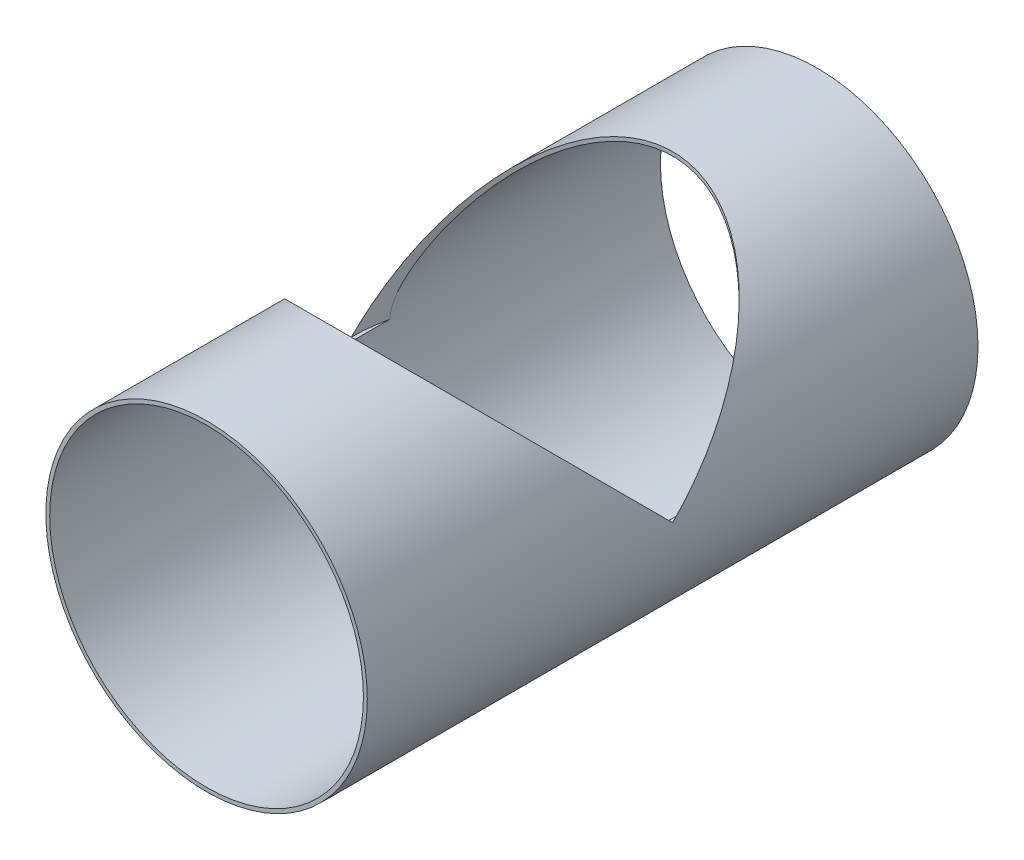
ISO-10303-21;
HEADER;
FILE_DESCRIPTION(('STEP AP214'),'2;1');
FILE_NAME('part.step','',(''),(''),'','','');
FILE_SCHEMA(('AUTOMOTIVE_DESIGN { 1 0 10303 214 1 1 1 1 }'));
ENDSEC;
DATA;
#1=APPLICATION_CONTEXT('core data for automotive mechanical design processes');
#2=APPLICATION_PROTOCOL_DEFINITION('international standard','automotive_design',2000,#1);
#3=PRODUCT_CONTEXT('',#1,'mechanical');
#4=PRODUCT('Part','Part','',(#3));
#5=PRODUCT_RELATED_PRODUCT_CATEGORY('part','',(#4));
#6=PRODUCT_DEFINITION_FORMATION('','',#4);
#7=PRODUCT_DEFINITION_CONTEXT('part definition',#1,'design');
#8=PRODUCT_DEFINITION('design','',#6,#7);
#9=PRODUCT_DEFINITION_SHAPE('','',#8);
#10=(LENGTH_UNIT() NAMED_UNIT(*) SI_UNIT(.MILLI.,.METRE.));
#11=(NAMED_UNIT(*) PLANE_ANGLE_UNIT() SI_UNIT($,.RADIAN.));
#12=(NAMED_UNIT(*) SI_UNIT($,.STERADIAN.) SOLID_ANGLE_UNIT());
#13=UNCERTAINTY_MEASURE_WITH_UNIT(LENGTH_MEASURE(1.E-05),#10,'distance_accuracy_value','');
#14=(GEOMETRIC_REPRESENTATION_CONTEXT(3) GLOBAL_UNCERTAINTY_ASSIGNED_CONTEXT((#13)) GLOBAL_UNIT_ASSIGNED_CONTEXT((#10,
#11,#12)) REPRESENTATION_CONTEXT('',''));
#15=CARTESIAN_POINT('',(0.,0.,0.));
#16=DIRECTION('',(0.,0.,1.));
#17=DIRECTION('',(1.,0.,0.));
#18=AXIS2_PLACEMENT_3D('',#15,#16,#17);
#19=CARTESIAN_POINT('',(0.,0.,241.3));
#20=DIRECTION('',(0.,-1.,0.));
#21=DIRECTION('',(0.,0.,-1.));
#22=AXIS2_PLACEMENT_3D('',#19,#20,#21);
#23=PLANE('',#22);
#24=CARTESIAN_POINT('',(0.,0.,241.3));
#25=DIRECTION('',(0.,1.,0.));
#26=DIRECTION('',(0.,0.,1.));
#27=AXIS2_PLACEMENT_3D('',#24,#25,#26);
#28=CIRCLE('',#27,127.);
#29=CARTESIAN_POINT('',(-123.952,0.,213.643143779526));
#30=VERTEX_POINT('',#29);
#31=CARTESIAN_POINT('',(-127.,0.,241.3));
#32=VERTEX_POINT('',#31);
#33=EDGE_CURVE('E34',#30,#32,#28,.T.);
#34=ORIENTED_EDGE('',*,*,#33,.T.);
#35=CARTESIAN_POINT('',(0.,0.,241.3));
#36=DIRECTION('',(0.,1.,0.));
#37=DIRECTION('',(0.,0.,1.));
#38=AXIS2_PLACEMENT_3D('',#35,#36,#37);
#39=CIRCLE('',#38,127.);
#40=CARTESIAN_POINT('',(-123.952,0.,268.956856220475));
#41=VERTEX_POINT('',#40);
#42=EDGE_CURVE('E67',#32,#41,#39,.T.);
#43=ORIENTED_EDGE('',*,*,#42,.T.);
#44=DIRECTION('',(0.,0.,1.));
#45=VECTOR('',#44,1.);
#46=CARTESIAN_POINT('',(-123.952,0.,0.));
#47=LINE('',#46,#45);
#48=EDGE_CURVE('E59',#41,#30,#47,.F.);
#49=ORIENTED_EDGE('',*,*,#48,.T.);
#50=EDGE_LOOP('',(#34,#43,#49));
#51=FACE_BOUND('',#50,.T.);
#52=ADVANCED_FACE('F17',(#51),#23,.F.);
#53=CARTESIAN_POINT('',(0.,0.,241.3));
#54=DIRECTION('',(0.,-1.,0.));
#55=DIRECTION('',(0.,0.,-1.));
#56=AXIS2_PLACEMENT_3D('',#53,#54,#55);
#57=PLANE('',#56);
#58=CARTESIAN_POINT('',(0.,0.,241.3));
#59=DIRECTION('',(0.,1.,0.));
#60=DIRECTION('',(0.,0.,1.));
#61=AXIS2_PLACEMENT_3D('',#58,#59,#60);
#62=CIRCLE('',#61,127.);
#63=CARTESIAN_POINT('',(123.952,0.,268.956856220475));
#64=VERTEX_POINT('',#63);
#65=CARTESIAN_POINT('',(127.,0.,241.3));
#66=VERTEX_POINT('',#65);
#67=EDGE_CURVE('E52',#64,#66,#62,.T.);
#68=ORIENTED_EDGE('',*,*,#67,.T.);
#69=CARTESIAN_POINT('',(0.,0.,241.3));
#70=DIRECTION('',(0.,1.,0.));
#71=DIRECTION('',(0.,0.,1.));
#72=AXIS2_PLACEMENT_3D('',#69,#70,#71);
#73=CIRCLE('',#72,127.);
#74=CARTESIAN_POINT('',(123.952,0.,213.643143779525));
#75=VERTEX_POINT('',#74);
#76=EDGE_CURVE('E55',#66,#75,#73,.T.);
#77=ORIENTED_EDGE('',*,*,#76,.T.);
#78=DIRECTION('',(0.,0.,1.));
#79=VECTOR('',#78,1.);
#80=CARTESIAN_POINT('',(123.952,0.,0.));
#81=LINE('',#80,#79);
#82=EDGE_CURVE('E48',#75,#64,#81,.T.);
#83=ORIENTED_EDGE('',*,*,#82,.T.);
#84=EDGE_LOOP('',(#68,#77,#83));
#85=FACE_BOUND('',#84,.T.);
#86=ADVANCED_FACE('F50',(#85),#57,.F.);
#87=CARTESIAN_POINT('',(0.,0.,0.));
#88=DIRECTION('',(0.,0.,1.));
#89=DIRECTION('',(1.,0.,0.));
#90=AXIS2_PLACEMENT_3D('',#87,#88,#89);
#91=CYLINDRICAL_SURFACE('',#90,123.952);
#92=CARTESIAN_POINT('',(0.,0.,0.));
#93=DIRECTION('',(0.,0.,1.));
#94=DIRECTION('',(1.,0.,0.));
#95=AXIS2_PLACEMENT_3D('',#92,#93,#94);
#96=CIRCLE('',#95,123.952);
#97=CARTESIAN_POINT('',(123.952,0.,0.));
#98=VERTEX_POINT('',#97);
#99=EDGE_CURVE('E115',#98,#98,#96,.T.);
#100=ORIENTED_EDGE('',*,*,#99,.F.);
#101=EDGE_LOOP('',(#100));
#102=FACE_BOUND('',#101,.T.);
#103=ORIENTED_EDGE('',*,*,#48,.F.);
#104=CARTESIAN_POINT('',(-123.952,0.,268.956856220475));
#105=CARTESIAN_POINT('',(-123.952011020941,0.489693864072951,268.956767550672));
#106=CARTESIAN_POINT('',(-123.949098421413,0.979353674165115,268.969859645185));
#107=CARTESIAN_POINT('',(-123.93750960443,1.95710301510144,269.021742255334));
#108=CARTESIAN_POINT('',(-123.928835074181,2.44519296360327,269.060525248166));
#109=CARTESIAN_POINT('',(-123.905844464658,3.41695982621533,269.162955575909));
#110=CARTESIAN_POINT('',(-123.891547363117,3.90064604262523,269.226519262929));
#111=CARTESIAN_POINT('',(-123.857463468549,4.86410426457651,269.377298750678));
#112=CARTESIAN_POINT('',(-123.837676342107,5.34387603056616,269.46451598791));
#113=CARTESIAN_POINT('',(-123.771365120799,6.75418303034597,269.755022157157));
#114=CARTESIAN_POINT('',(-123.717344072959,7.6780339392297,269.989658671327));
#115=CARTESIAN_POINT('',(-123.590544546681,9.50339339249372,270.531047692229));
#116=CARTESIAN_POINT('',(-123.517749587749,10.4048815398839,270.837863539996));
#117=CARTESIAN_POINT('',(-123.352351129205,12.2125326181803,271.521265365455));
#118=CARTESIAN_POINT('',(-123.259183593303,13.1179054398859,271.899785371579));
#119=CARTESIAN_POINT('',(-123.055967836939,14.9042178249446,272.707038253618));
#120=CARTESIAN_POINT('',(-122.945912775111,15.7851473144156,273.135791462967));
#121=CARTESIAN_POINT('',(-122.70994299976,17.5254176891227,274.033555165375));
#122=CARTESIAN_POINT('',(-122.584007328721,18.3847282127419,274.502618590091));
#123=CARTESIAN_POINT('',(-122.317279917598,20.0828259226082,275.472150464939));
#124=CARTESIAN_POINT('',(-122.176490027225,20.9216156482066,275.972615001731));
#125=CARTESIAN_POINT('',(-121.877890985743,22.5968008697635,277.008200649651));
#126=CARTESIAN_POINT('',(-121.719810830721,23.4328525638902,277.543797502889));
#127=CARTESIAN_POINT('',(-121.389368919165,25.0884823042615,278.635593099761));
#128=CARTESIAN_POINT('',(-121.21700693182,25.9080600840031,279.19179217627));
#129=CARTESIAN_POINT('',(-120.858492510236,27.5320539348548,280.320187189937));
#130=CARTESIAN_POINT('',(-120.672350900777,28.3364812972864,280.892370355091));
#131=CARTESIAN_POINT('',(-120.286402868233,29.9324829816578,282.04989114035));
#132=CARTESIAN_POINT('',(-120.086596199326,30.7240570720626,282.635228996968));
#133=CARTESIAN_POINT('',(-119.598503871152,32.5810233544121,284.030841468407));
#134=CARTESIAN_POINT('',(-119.304429892846,33.6415000531877,284.845634396049));
#135=CARTESIAN_POINT('',(-118.691467616286,35.7439882342735,286.489661676147));
#136=CARTESIAN_POINT('',(-118.372577707113,36.7859985124416,287.318896963409));
#137=CARTESIAN_POINT('',(-117.710051942199,38.8538401567015,288.988050366681));
#138=CARTESIAN_POINT('',(-117.366410793882,39.8796680049844,289.827970735688));
#139=CARTESIAN_POINT('',(-116.6544649144,41.9165602011641,291.515280845261));
#140=CARTESIAN_POINT('',(-116.286159362418,42.9276240563582,292.362670833596));
#141=CARTESIAN_POINT('',(-115.524417491543,44.9373272960421,294.063416734757));
#142=CARTESIAN_POINT('',(-115.130952746341,45.935951047356,294.916778389875));
#143=CARTESIAN_POINT('',(-114.319181973177,47.9204759738686,296.626489769393));
#144=CARTESIAN_POINT('',(-113.900875323978,48.9063768301466,297.482839568014));
#145=CARTESIAN_POINT('',(-112.608621730792,51.8457346124009,300.053514346088));
#146=CARTESIAN_POINT('',(-111.697206682503,53.7812011998046,301.769766380162));
#147=CARTESIAN_POINT('',(-109.779744549404,57.5936322197357,305.184406161588));
#148=CARTESIAN_POINT('',(-108.774384921229,59.4709055160068,306.882835933242));
#149=CARTESIAN_POINT('',(-106.662049244613,63.1811880251185,310.265084281451));
#150=CARTESIAN_POINT('',(-105.555068917935,65.0141953702522,311.948902239577));
#151=CARTESIAN_POINT('',(-103.238451263471,68.6333229350197,315.29295177185));
#152=CARTESIAN_POINT('',(-102.028890333737,70.4194767735353,316.953199842601));
#153=CARTESIAN_POINT('',(-99.5043749570593,73.9437325191284,320.244157771456));
#154=CARTESIAN_POINT('',(-98.1894285583283,75.6818380820093,321.874869873562));
#155=CARTESIAN_POINT('',(-95.8164892483885,78.6503955816738,324.670307647633));
#156=CARTESIAN_POINT('',(-94.7833249333374,79.8927720294098,325.843477912037));
#157=CARTESIAN_POINT('',(-92.6582348627995,82.3479592227882,328.167320059574));
#158=CARTESIAN_POINT('',(-91.566305860621,83.560768329474,329.317990694827));
#159=CARTESIAN_POINT('',(-88.2008102416357,87.1520539125724,332.732099185853));
#160=CARTESIAN_POINT('',(-85.8373095084628,89.4836721545077,334.957901068499));
#161=CARTESIAN_POINT('',(-82.1101491212451,92.8700071111859,338.200128643643));
#162=CARTESIAN_POINT('',(-80.8376024358126,93.9801475665536,339.264673944297));
#163=CARTESIAN_POINT('',(-78.2308789080266,96.1608828791661,341.358603078765));
#164=CARTESIAN_POINT('',(-76.8967011996589,97.2314771803438,342.387986418144));
#165=CARTESIAN_POINT('',(-74.1668149208836,99.3294734524527,344.407542665146));
#166=CARTESIAN_POINT('',(-72.7711223492047,100.356886519699,345.397725642273));
#167=CARTESIAN_POINT('',(-69.9179165276626,102.365168028943,347.335180358721));
#168=CARTESIAN_POINT('',(-68.4604023202155,103.346035749481,348.282451432889));
#169=CARTESIAN_POINT('',(-64.697341304826,105.762258286555,350.617961316481));
#170=CARTESIAN_POINT('',(-62.3503465969223,107.164147479397,351.974961904854));
#171=CARTESIAN_POINT('',(-58.7247549461614,109.166886582171,353.915646145208));
#172=CARTESIAN_POINT('',(-57.4986299434309,109.817820420253,354.546773657985));
#173=CARTESIAN_POINT('',(-55.0118154725324,111.08440430463,355.775424804105));
#174=CARTESIAN_POINT('',(-53.7511288000726,111.70005719244,356.372951143601));
#175=CARTESIAN_POINT('',(-51.1963880624102,112.893825004869,357.532082749855));
#176=CARTESIAN_POINT('',(-49.9023427942914,113.47194968749,358.093697353731));
#177=CARTESIAN_POINT('',(-47.2818110959667,114.588641929481,359.178926172497));
#178=CARTESIAN_POINT('',(-45.9553281994291,115.127213772268,359.70254450216));
#179=CARTESIAN_POINT('',(-43.2709850284515,116.162773567905,360.709702928074));
#180=CARTESIAN_POINT('',(-41.9131199487956,116.659755097918,361.193236833935));
#181=CARTESIAN_POINT('',(-39.1680688961801,117.609820458803,362.117878022704));
#182=CARTESIAN_POINT('',(-37.7808863044784,118.062909318628,362.558990165994));
#183=CARTESIAN_POINT('',(-34.9647768110714,118.927516512668,363.4009669319));
#184=CARTESIAN_POINT('',(-33.5355684570793,119.338563753142,363.801375199479));
#185=CARTESIAN_POINT('',(-30.6515596706631,120.111651946725,364.554626930098));
#186=CARTESIAN_POINT('',(-29.1967591914413,120.47369281021,364.907470306151));
#187=CARTESIAN_POINT('',(-26.2642892920391,121.146805734807,365.563609291978));
#188=CARTESIAN_POINT('',(-24.7866190962499,121.457876063129,365.866903217272));
#189=CARTESIAN_POINT('',(-21.8115729774985,122.027239932611,366.422120360976));
#190=CARTESIAN_POINT('',(-20.3141971400322,122.28553370267,366.674043802186));
#191=CARTESIAN_POINT('',(-17.304524795442,122.747576259917,367.12474552996));
#192=CARTESIAN_POINT('',(-15.7922430915943,122.951374424678,367.32357192667));
#193=CARTESIAN_POINT('',(-12.7550876580271,123.303459280308,367.667097288876));
#194=CARTESIAN_POINT('',(-11.2302137985748,123.451745398524,367.811795695996));
#195=CARTESIAN_POINT('',(-8.17202814603243,123.69182871092,368.046082774924));
#196=CARTESIAN_POINT('',(-6.63871760409742,123.78363406487,368.135679407276));
#197=CARTESIAN_POINT('',(-3.56754101802112,123.910179949448,368.259183198254));
#198=CARTESIAN_POINT('',(-2.02967517190124,123.94492292517,368.293092743042));
#199=CARTESIAN_POINT('',(0.811049251287533,123.956193318992,368.304092706703));
#200=CARTESIAN_POINT('',(2.11385800147762,123.940815638354,368.289083853325));
#201=CARTESIAN_POINT('',(4.71726203527143,123.86904900599,368.21904086711));
#202=CARTESIAN_POINT('',(6.01785735497199,123.812660729619,368.164007393391));
#203=CARTESIAN_POINT('',(8.61417234088342,123.659149630658,368.014192984702));
#204=CARTESIAN_POINT('',(9.90989259961644,123.562031931107,367.919417048629));
#205=CARTESIAN_POINT('',(12.4942063388951,123.327517395619,367.690575542086));
#206=CARTESIAN_POINT('',(13.7827997485841,123.190120159946,367.556509581699));
#207=CARTESIAN_POINT('',(16.3505198858346,122.875676455128,367.249721601852));
#208=CARTESIAN_POINT('',(17.6296464938693,122.698629486249,367.076999095176));
#209=CARTESIAN_POINT('',(20.1761906210981,122.305680467752,366.693697205242));
#210=CARTESIAN_POINT('',(21.4436081810691,122.089778553501,366.483117953872));
#211=CARTESIAN_POINT('',(23.9646863885406,121.620048905917,366.025038744343));
#212=CARTESIAN_POINT('',(25.2183467198734,121.366220302906,365.777537939554));
#213=CARTESIAN_POINT('',(27.7099731558745,120.821694695203,365.246681803874));
#214=CARTESIAN_POINT('',(28.9479390908207,120.530997292177,364.963326085605));
#215=CARTESIAN_POINT('',(31.3816853909027,119.920100176779,364.367979297532));
#216=CARTESIAN_POINT('',(32.5778134679895,119.6006112711,364.056678632142));
#217=CARTESIAN_POINT('',(34.9517726567348,118.928523665959,363.401964257631));
#218=CARTESIAN_POINT('',(36.1296044291648,118.57592616547,363.058551711391));
#219=CARTESIAN_POINT('',(38.4655781448433,117.838861766246,362.340869080338));
#220=CARTESIAN_POINT('',(39.623722244966,117.454398386035,361.966602402358));
#221=CARTESIAN_POINT('',(41.9193800027819,116.654797699763,361.188427634307));
#222=CARTESIAN_POINT('',(43.0568910578416,116.23965655709,360.784515836811));
#223=CARTESIAN_POINT('',(46.4367346419114,114.950169291023,359.530297144875));
#224=CARTESIAN_POINT('',(48.6467312795801,114.031647177511,358.637397715076));
#225=CARTESIAN_POINT('',(52.9736193474211,112.087121516104,356.748564790205));
#226=CARTESIAN_POINT('',(55.0904910067922,111.061095299531,355.752609564992));
#227=CARTESIAN_POINT('',(58.6772860917251,109.197091271813,353.944881964946));
#228=CARTESIAN_POINT('',(60.1697396115705,108.381523304644,353.154425625256));
#229=CARTESIAN_POINT('',(63.1007544810336,106.701666420436,351.527508098131));
#230=CARTESIAN_POINT('',(64.5393255188766,105.837386332657,350.691055248406));
#231=CARTESIAN_POINT('',(67.3627192979342,104.063170574076,348.975410548933));
#232=CARTESIAN_POINT('',(68.7475203148485,103.153216783577,348.096201741396));
#233=CARTESIAN_POINT('',(71.4625421418936,101.291229465009,346.298836882957));
#234=CARTESIAN_POINT('',(72.7927601952655,100.339193816593,345.380678869644));
#235=CARTESIAN_POINT('',(75.4017554216645,98.3937394704166,343.506464588534));
#236=CARTESIAN_POINT('',(76.6803975451992,97.4002244438479,342.550320385539));
#237=CARTESIAN_POINT('',(79.1828479850641,95.3769575792425,340.60552892521));
#238=CARTESIAN_POINT('',(80.406657499111,94.3472065335925,339.616882378649));
#239=CARTESIAN_POINT('',(83.9964541554987,91.2074655672228,336.606600605882));
#240=CARTESIAN_POINT('',(86.281307446932,89.0466142377244,334.540263003044));
#241=CARTESIAN_POINT('',(89.955557294752,85.3033402513457,330.973564644128));
#242=CARTESIAN_POINT('',(91.4014198815321,83.7515182850217,329.498445455526));
#243=CARTESIAN_POINT('',(94.1945676479981,80.5972651873877,326.508963304341));
#244=CARTESIAN_POINT('',(95.5418450712251,78.9948300881197,324.994597266571));
#245=CARTESIAN_POINT('',(98.1399669602662,75.7428476295021,321.932380704931));
#246=CARTESIAN_POINT('',(99.390769068584,74.0932800073085,320.384515851046));
#247=CARTESIAN_POINT('',(101.797157809629,70.7508130529787,317.261987103669));
#248=CARTESIAN_POINT('',(102.952747154979,69.0579149571353,315.687323975208));
#249=CARTESIAN_POINT('',(105.168365905974,65.6343102433315,312.520376072715));
#250=CARTESIAN_POINT('',(106.228578544209,63.9036844163572,310.928131984236));
#251=CARTESIAN_POINT('',(108.257703162176,60.4025027820099,307.729337343083));
#252=CARTESIAN_POINT('',(109.226611962659,58.6319455868623,306.122786294364));
#253=CARTESIAN_POINT('',(111.074116282934,55.0517487196469,302.903433832669));
#254=CARTESIAN_POINT('',(111.952756827728,53.2421290820266,301.290635956242));
#255=CARTESIAN_POINT('',(113.6214492402,49.581364212685,298.06670881502));
#256=CARTESIAN_POINT('',(114.411510209338,47.7302232707333,296.455579395679));
#257=CARTESIAN_POINT('',(115.757785125788,44.3493356589938,293.560506612851));
#258=CARTESIAN_POINT('',(116.329488244083,42.8276764223616,292.2743032956));
#259=CARTESIAN_POINT('',(117.416418427006,39.7510395465123,289.718106452104));
#260=CARTESIAN_POINT('',(117.931648664716,38.1960637851494,288.448112018666));
#261=CARTESIAN_POINT('',(118.907200498239,35.0415821737985,285.930750107903));
#262=CARTESIAN_POINT('',(119.367330108593,33.441943280929,284.683473890261));
#263=CARTESIAN_POINT('',(120.014191411341,31.0063954120127,282.845359616531));
#264=CARTESIAN_POINT('',(120.222583979723,30.1885566288142,282.23813950726));
#265=CARTESIAN_POINT('',(120.624745878574,28.5392640028473,281.037530308266));
#266=CARTESIAN_POINT('',(120.818515646855,27.7078105686139,280.444140804819));
#267=CARTESIAN_POINT('',(121.272796036673,25.6619598739746,279.018518140726));
#268=CARTESIAN_POINT('',(121.525371963533,24.4393211793623,278.195492273793));
#269=CARTESIAN_POINT('',(121.99862002384,21.9552748714282,276.599142751869));
#270=CARTESIAN_POINT('',(122.219284663846,20.6938582362783,275.825830794354));
#271=CARTESIAN_POINT('',(122.624624300902,18.1372324999578,274.357157513543));
#272=CARTESIAN_POINT('',(122.809632411179,16.8424786861095,273.661103356247));
#273=CARTESIAN_POINT('',(123.143180351298,14.1995430322556,272.367706304122));
#274=CARTESIAN_POINT('',(123.29173922055,12.8513895150915,271.770311927493));
#275=CARTESIAN_POINT('',(123.503839952023,10.5699860948421,270.896113818204));
#276=CARTESIAN_POINT('',(123.579063161223,9.65308396372725,270.57963923742));
#277=CARTESIAN_POINT('',(123.71009110791,7.79591027309665,270.021000245555));
#278=CARTESIAN_POINT('',(123.765914057037,6.85566152323024,269.778766167928));
#279=CARTESIAN_POINT('',(123.834315964661,5.42179032889008,269.479298094068));
#280=CARTESIAN_POINT('',(123.854678678369,4.93518690557021,269.38958684583));
#281=CARTESIAN_POINT('',(123.889758597162,3.95790114351653,269.234459770035));
#282=CARTESIAN_POINT('',(123.904476162782,3.46721906731704,269.169042390926));
#283=CARTESIAN_POINT('',(123.928145853596,2.48128343536041,269.063605089683));
#284=CARTESIAN_POINT('',(123.93707806385,1.9860199791888,269.023672902107));
#285=CARTESIAN_POINT('',(123.949011885285,0.993850190394975,268.970247426332));
#286=CARTESIAN_POINT('',(123.952011666046,0.496943398084879,268.956762298252));
#287=CARTESIAN_POINT('',(123.952,0.,268.956856220474));
#288=B_SPLINE_CURVE_WITH_KNOTS('',3,(#104,#105,#106,#107,#108,#109,#110,#111,#112,#113,#114,
#115,#116,#117,#118,#119,#120,#121,#122,#123,#124,#125,#126,#127,#128,#129,#130,#131,#132,#133,
#134,#135,#136,#137,#138,#139,#140,#141,#142,#143,#144,#145,#146,#147,#148,#149,#150,#151,#152,
#153,#154,#155,#156,#157,#158,#159,#160,#161,#162,#163,#164,#165,#166,#167,#168,#169,#170,#171,
#172,#173,#174,#175,#176,#177,#178,#179,#180,#181,#182,#183,#184,#185,#186,#187,#188,#189,#190,
#191,#192,#193,#194,#195,#196,#197,#198,#199,#200,#201,#202,#203,#204,#205,#206,#207,#208,#209,
#210,#211,#212,#213,#214,#215,#216,#217,#218,#219,#220,#221,#222,#223,#224,#225,#226,#227,#228,
#229,#230,#231,#232,#233,#234,#235,#236,#237,#238,#239,#240,#241,#242,#243,#244,#245,#246,#247,
#248,#249,#250,#251,#252,#253,#254,#255,#256,#257,#258,#259,#260,#261,#262,#263,#264,#265,#266,
#267,#268,#269,#270,#271,#272,#273,#274,#275,#276,#277,#278,#279,#280,#281,#282,#283,#284,#285,
#286,#287),.UNSPECIFIED.,.F.,.F.,(4,2,2,2,2,2,2,2,2,2,2,2,2,2,2,2,2,2,2,2,2,2,2,2,2,2,2,2,2,2,2,
2,2,2,2,2,2,2,2,2,2,2,2,2,2,2,2,2,2,2,2,2,2,2,2,2,2,2,2,2,2,2,2,2,2,2,2,2,2,2,2,2,2,2,2,2,2,2,2,
2,2,2,2,2,2,2,2,2,2,2,2,4),(0.,1.46884213506858,2.93725435412535,4.40075223729575,
5.86433901998603,8.72439140425188,11.5869630543818,14.5420273562118,17.4982919708265,
20.4584995947677,23.4183390350073,26.4340262184687,29.4497621483361,32.463153662109,
35.476599398129,39.5839914139544,43.6916502827543,47.8001901181348,51.9088667513939,
56.0222705639571,60.1357772863152,68.3613383674291,76.5308261654055,84.7006580572842,
92.8644579283032,101.027634928803,107.016866234399,113.006428779579,124.984205861962,
130.971704027853,136.959286353257,142.945320518325,148.931447437742,158.078090612477,
162.651969205204,167.225478900314,171.797794598222,176.369614399905,180.942138934797,
185.514138956799,190.132767531816,194.751404553343,199.370198557131,203.988972528205,
208.603547213236,213.218169500164,217.832124956573,222.44588270225,226.353617290922,
230.261287529223,234.16846639937,238.075684045911,241.982950940683,245.890204223241,
249.797547114762,253.704932225032,257.533744211955,261.36241759823,265.190668796981,
269.019399576098,276.675703571298,284.333625262086,289.958114390255,295.58158731633,
301.207309099971,306.833314666615,312.473204343032,318.112970766398,329.390351233493,
337.138604732313,344.887467192267,352.63971265074,360.391737170364,368.128535835111,
375.865603800111,383.598793654324,391.331188201655,397.548659503932,403.765781281456,
410.003971020279,413.122876137309,416.241687836221,420.726345884461,425.212055320807,
429.653577020754,434.092773710606,437.008883825897,439.922249054466,441.4073772969,
442.892410673806,444.382529191507,445.873107406138),.UNSPECIFIED.);
#289=EDGE_CURVE('E63',#41,#64,#288,.T.);
#290=ORIENTED_EDGE('',*,*,#289,.T.);
#291=ORIENTED_EDGE('',*,*,#82,.F.);
#292=CARTESIAN_POINT('',(123.952,0.,213.643143779525));
#293=CARTESIAN_POINT('',(123.952011020941,0.489693864072942,213.643232449328));
#294=CARTESIAN_POINT('',(123.949098421413,0.979353674165101,213.630140354815));
#295=CARTESIAN_POINT('',(123.93750960443,1.95710301510142,213.578257744666));
#296=CARTESIAN_POINT('',(123.928835074181,2.44519296360324,213.539474751834));
#297=CARTESIAN_POINT('',(123.905844464658,3.41695982621531,213.437044424091));
#298=CARTESIAN_POINT('',(123.891547363117,3.90064604262521,213.373480737071));
#299=CARTESIAN_POINT('',(123.857463468549,4.86410426457648,213.222701249322));
#300=CARTESIAN_POINT('',(123.837676342107,5.34387603056613,213.13548401209));
#301=CARTESIAN_POINT('',(123.771365120799,6.75418303034593,212.844977842843));
#302=CARTESIAN_POINT('',(123.717344072959,7.67803393922966,212.610341328673));
#303=CARTESIAN_POINT('',(123.590544546681,9.50339339249369,212.068952307771));
#304=CARTESIAN_POINT('',(123.517749587749,10.4048815398838,211.762136460004));
#305=CARTESIAN_POINT('',(123.352351129205,12.2125326181804,211.078734634545));
#306=CARTESIAN_POINT('',(123.259183593303,13.1179054398859,210.700214628422));
#307=CARTESIAN_POINT('',(123.055967836939,14.9042178249446,209.892961746382));
#308=CARTESIAN_POINT('',(122.945912775111,15.7851473144156,209.464208537033));
#309=CARTESIAN_POINT('',(122.70994299976,17.5254176891226,208.566444834625));
#310=CARTESIAN_POINT('',(122.584007328721,18.3847282127418,208.097381409909));
#311=CARTESIAN_POINT('',(122.317279917598,20.0828259226082,207.127849535061));
#312=CARTESIAN_POINT('',(122.176490027225,20.9216156482067,206.627384998269));
#313=CARTESIAN_POINT('',(121.877890985743,22.5968008697635,205.591799350349));
#314=CARTESIAN_POINT('',(121.719810830721,23.4328525638902,205.056202497111));
#315=CARTESIAN_POINT('',(121.389368919165,25.0884823042615,203.964406900239));
#316=CARTESIAN_POINT('',(121.21700693182,25.9080600840031,203.40820782373));
#317=CARTESIAN_POINT('',(120.858492510236,27.5320539348548,202.279812810063));
#318=CARTESIAN_POINT('',(120.672350900777,28.3364812972864,201.707629644909));
#319=CARTESIAN_POINT('',(120.286402868233,29.9324829816578,200.55010885965));
#320=CARTESIAN_POINT('',(120.086596199326,30.7240570720626,199.964771003032));
#321=CARTESIAN_POINT('',(119.598503871152,32.5810233544121,198.569158531593));
#322=CARTESIAN_POINT('',(119.304429892846,33.6415000531877,197.754365603951));
#323=CARTESIAN_POINT('',(118.691467616286,35.7439882342735,196.110338323853));
#324=CARTESIAN_POINT('',(118.372577707113,36.7859985124417,195.281103036591));
#325=CARTESIAN_POINT('',(117.710051942199,38.8538401567015,193.611949633319));
#326=CARTESIAN_POINT('',(117.366410793882,39.8796680049844,192.772029264312));
#327=CARTESIAN_POINT('',(116.6544649144,41.9165602011641,191.084719154739));
#328=CARTESIAN_POINT('',(116.286159362418,42.9276240563583,190.237329166404));
#329=CARTESIAN_POINT('',(115.524417491543,44.9373272960421,188.536583265243));
#330=CARTESIAN_POINT('',(115.130952746341,45.9359510473561,187.683221610125));
#331=CARTESIAN_POINT('',(114.319181973177,47.9204759738686,185.973510230607));
#332=CARTESIAN_POINT('',(113.900875323978,48.9063768301466,185.117160431986));
#333=CARTESIAN_POINT('',(112.608621730792,51.845734612401,182.546485653912));
#334=CARTESIAN_POINT('',(111.697206682503,53.7812011998046,180.830233619838));
#335=CARTESIAN_POINT('',(109.779744549404,57.5936322197357,177.415593838412));
#336=CARTESIAN_POINT('',(108.774384921229,59.4709055160069,175.717164066758));
#337=CARTESIAN_POINT('',(106.662049244613,63.1811880251185,172.334915718549));
#338=CARTESIAN_POINT('',(105.555068917935,65.0141953702522,170.651097760423));
#339=CARTESIAN_POINT('',(103.238451263471,68.6333229350197,167.30704822815));
#340=CARTESIAN_POINT('',(102.028890333737,70.4194767735353,165.646800157399));
#341=CARTESIAN_POINT('',(99.5043749570593,73.9437325191283,162.355842228544));
#342=CARTESIAN_POINT('',(98.1894285583284,75.6818380820093,160.725130126438));
#343=CARTESIAN_POINT('',(95.8164892483885,78.6503955816738,157.929692352367));
#344=CARTESIAN_POINT('',(94.7833249333374,79.8927720294097,156.756522087963));
#345=CARTESIAN_POINT('',(92.6582348627995,82.3479592227882,154.432679940426));
#346=CARTESIAN_POINT('',(91.566305860621,83.560768329474,153.282009305173));
#347=CARTESIAN_POINT('',(88.2008102416357,87.1520539125724,149.867900814147));
#348=CARTESIAN_POINT('',(85.8373095084627,89.4836721545077,147.642098931501));
#349=CARTESIAN_POINT('',(82.110149121245,92.870007111186,144.399871356357));
#350=CARTESIAN_POINT('',(80.8376024358125,93.9801475665536,143.335326055703));
#351=CARTESIAN_POINT('',(78.2308789080265,96.1608828791661,141.241396921234));
#352=CARTESIAN_POINT('',(76.8967011996588,97.2314771803438,140.212013581856));
#353=CARTESIAN_POINT('',(74.1668149208835,99.3294734524527,138.192457334854));
#354=CARTESIAN_POINT('',(72.7711223492046,100.356886519699,137.202274357726));
#355=CARTESIAN_POINT('',(69.9179165276626,102.365168028943,135.264819641279));
#356=CARTESIAN_POINT('',(68.4604023202154,103.346035749481,134.317548567111));
#357=CARTESIAN_POINT('',(64.6973413048259,105.762258286556,131.982038683519));
#358=CARTESIAN_POINT('',(62.3503465969223,107.164147479397,130.625038095146));
#359=CARTESIAN_POINT('',(58.7247549461613,109.166886582171,128.684353854792));
#360=CARTESIAN_POINT('',(57.4986299434308,109.817820420253,128.053226342015));
#361=CARTESIAN_POINT('',(55.0118154725324,111.08440430463,126.824575195895));
#362=CARTESIAN_POINT('',(53.7511288000725,111.70005719244,126.227048856399));
#363=CARTESIAN_POINT('',(51.1963880624102,112.893825004869,125.067917250145));
#364=CARTESIAN_POINT('',(49.9023427942914,113.47194968749,124.506302646269));
#365=CARTESIAN_POINT('',(47.2818110959666,114.588641929481,123.421073827503));
#366=CARTESIAN_POINT('',(45.9553281994291,115.127213772268,122.89745549784));
#367=CARTESIAN_POINT('',(43.2709850284514,116.162773567905,121.890297071926));
#368=CARTESIAN_POINT('',(41.9131199487956,116.659755097918,121.406763166065));
#369=CARTESIAN_POINT('',(39.16806889618,117.609820458803,120.482121977296));
#370=CARTESIAN_POINT('',(37.7808863044783,118.062909318628,120.041009834006));
#371=CARTESIAN_POINT('',(34.9647768110713,118.927516512668,119.1990330681));
#372=CARTESIAN_POINT('',(33.5355684570792,119.338563753142,118.798624800521));
#373=CARTESIAN_POINT('',(30.6515596706631,120.111651946725,118.045373069902));
#374=CARTESIAN_POINT('',(29.1967591914412,120.47369281021,117.692529693849));
#375=CARTESIAN_POINT('',(26.2642892920391,121.146805734807,117.036390708022));
#376=CARTESIAN_POINT('',(24.7866190962499,121.457876063129,116.733096782728));
#377=CARTESIAN_POINT('',(21.8115729774985,122.027239932611,116.177879639024));
#378=CARTESIAN_POINT('',(20.3141971400321,122.28553370267,115.925956197814));
#379=CARTESIAN_POINT('',(17.304524795442,122.747576259917,115.47525447004));
#380=CARTESIAN_POINT('',(15.7922430915943,122.951374424678,115.27642807333));
#381=CARTESIAN_POINT('',(12.7550876580271,123.303459280308,114.932902711125));
#382=CARTESIAN_POINT('',(11.2302137985748,123.451745398524,114.788204304004));
#383=CARTESIAN_POINT('',(8.17202814603243,123.69182871092,114.553917225076));
#384=CARTESIAN_POINT('',(6.63871760409742,123.78363406487,114.464320592724));
#385=CARTESIAN_POINT('',(3.56754101802113,123.910179949448,114.340816801746));
#386=CARTESIAN_POINT('',(2.02967517190125,123.94492292517,114.306907256958));
#387=CARTESIAN_POINT('',(-0.811049251287533,123.956193318992,114.295907293297));
#388=CARTESIAN_POINT('',(-2.11385800147763,123.940815638354,114.310916146675));
#389=CARTESIAN_POINT('',(-4.71726203527145,123.86904900599,114.38095913289));
#390=CARTESIAN_POINT('',(-6.017857354972,123.812660729619,114.435992606609));
#391=CARTESIAN_POINT('',(-8.61417234088342,123.659149630658,114.585807015298));
#392=CARTESIAN_POINT('',(-9.90989259961644,123.562031931107,114.680582951371));
#393=CARTESIAN_POINT('',(-12.4942063388951,123.327517395619,114.909424457914));
#394=CARTESIAN_POINT('',(-13.7827997485841,123.190120159946,115.043490418301));
#395=CARTESIAN_POINT('',(-16.3505198858346,122.875676455128,115.350278398148));
#396=CARTESIAN_POINT('',(-17.6296464938693,122.698629486249,115.523000904824));
#397=CARTESIAN_POINT('',(-20.1761906210981,122.305680467752,115.906302794758));
#398=CARTESIAN_POINT('',(-21.4436081810691,122.089778553501,116.116882046128));
#399=CARTESIAN_POINT('',(-23.9646863885406,121.620048905917,116.574961255657));
#400=CARTESIAN_POINT('',(-25.2183467198734,121.366220302906,116.822462060446));
#401=CARTESIAN_POINT('',(-27.7099731558745,120.821694695203,117.353318196125));
#402=CARTESIAN_POINT('',(-28.9479390908207,120.530997292177,117.636673914395));
#403=CARTESIAN_POINT('',(-31.3816853909027,119.920100176779,118.232020702468));
#404=CARTESIAN_POINT('',(-32.5778134679895,119.6006112711,118.543321367858));
#405=CARTESIAN_POINT('',(-34.9517726567347,118.928523665959,119.198035742369));
#406=CARTESIAN_POINT('',(-36.1296044291648,118.57592616547,119.541448288609));
#407=CARTESIAN_POINT('',(-38.4655781448433,117.838861766246,120.259130919663));
#408=CARTESIAN_POINT('',(-39.623722244966,117.454398386035,120.633397597642));
#409=CARTESIAN_POINT('',(-41.9193800027819,116.654797699763,121.411572365693));
#410=CARTESIAN_POINT('',(-43.0568910578415,116.23965655709,121.815484163189));
#411=CARTESIAN_POINT('',(-46.4367346419114,114.950169291023,123.069702855125));
#412=CARTESIAN_POINT('',(-48.6467312795801,114.031647177511,123.962602284924));
#413=CARTESIAN_POINT('',(-52.9736193474211,112.087121516104,125.851435209795));
#414=CARTESIAN_POINT('',(-55.0904910067922,111.061095299531,126.847390435008));
#415=CARTESIAN_POINT('',(-58.6772860917251,109.197091271813,128.655118035054));
#416=CARTESIAN_POINT('',(-60.1697396115705,108.381523304644,129.445574374744));
#417=CARTESIAN_POINT('',(-63.1007544810336,106.701666420436,131.072491901869));
#418=CARTESIAN_POINT('',(-64.5393255188766,105.837386332657,131.908944751594));
#419=CARTESIAN_POINT('',(-67.3627192979342,104.063170574076,133.624589451067));
#420=CARTESIAN_POINT('',(-68.7475203148485,103.153216783577,134.503798258604));
#421=CARTESIAN_POINT('',(-71.4625421418936,101.291229465009,136.301163117043));
#422=CARTESIAN_POINT('',(-72.7927601952655,100.339193816593,137.219321130356));
#423=CARTESIAN_POINT('',(-75.4017554216645,98.3937394704165,139.093535411466));
#424=CARTESIAN_POINT('',(-76.6803975451993,97.4002244438479,140.049679614461));
#425=CARTESIAN_POINT('',(-79.1828479850642,95.3769575792424,141.99447107479));
#426=CARTESIAN_POINT('',(-80.4066574991111,94.3472065335924,142.983117621351));
#427=CARTESIAN_POINT('',(-83.9964541554987,91.2074655672228,145.993399394118));
#428=CARTESIAN_POINT('',(-86.2813074469321,89.0466142377243,148.059736996956));
#429=CARTESIAN_POINT('',(-89.955557294752,85.3033402513456,151.626435355872));
#430=CARTESIAN_POINT('',(-91.4014198815322,83.7515182850216,153.101554544474));
#431=CARTESIAN_POINT('',(-94.1945676479982,80.5972651873876,156.091036695659));
#432=CARTESIAN_POINT('',(-95.5418450712251,78.9948300881196,157.605402733429));
#433=CARTESIAN_POINT('',(-98.1399669602662,75.742847629502,160.667619295069));
#434=CARTESIAN_POINT('',(-99.390769068584,74.0932800073085,162.215484148954));
#435=CARTESIAN_POINT('',(-101.797157809629,70.7508130529787,165.338012896331));
#436=CARTESIAN_POINT('',(-102.952747154979,69.0579149571352,166.912676024792));
#437=CARTESIAN_POINT('',(-105.168365905974,65.6343102433314,170.079623927285));
#438=CARTESIAN_POINT('',(-106.228578544209,63.9036844163572,171.671868015764));
#439=CARTESIAN_POINT('',(-108.257703162176,60.4025027820098,174.870662656917));
#440=CARTESIAN_POINT('',(-109.226611962659,58.6319455868622,176.477213705636));
#441=CARTESIAN_POINT('',(-111.074116282934,55.0517487196468,179.696566167331));
#442=CARTESIAN_POINT('',(-111.952756827728,53.2421290820265,181.309364043758));
#443=CARTESIAN_POINT('',(-113.6214492402,49.5813642126849,184.53329118498));
#444=CARTESIAN_POINT('',(-114.411510209338,47.7302232707333,186.144420604321));
#445=CARTESIAN_POINT('',(-115.757785125788,44.3493356589937,189.039493387149));
#446=CARTESIAN_POINT('',(-116.329488244083,42.8276764223615,190.3256967044));
#447=CARTESIAN_POINT('',(-117.416418427006,39.7510395465122,192.881893547896));
#448=CARTESIAN_POINT('',(-117.931648664716,38.1960637851494,194.151887981334));
#449=CARTESIAN_POINT('',(-118.907200498239,35.0415821737985,196.669249892097));
#450=CARTESIAN_POINT('',(-119.367330108593,33.441943280929,197.916526109739));
#451=CARTESIAN_POINT('',(-120.014191411341,31.0063954120127,199.754640383469));
#452=CARTESIAN_POINT('',(-120.222583979723,30.1885566288141,200.36186049274));
#453=CARTESIAN_POINT('',(-120.624745878574,28.5392640028473,201.562469691734));
#454=CARTESIAN_POINT('',(-120.818515646855,27.7078105686139,202.155859195181));
#455=CARTESIAN_POINT('',(-121.272796036673,25.6619598739746,203.581481859275));
#456=CARTESIAN_POINT('',(-121.525371963533,24.4393211793623,204.404507726207));
#457=CARTESIAN_POINT('',(-121.99862002384,21.9552748714282,206.000857248131));
#458=CARTESIAN_POINT('',(-122.219284663846,20.6938582362784,206.774169205646));
#459=CARTESIAN_POINT('',(-122.624624300902,18.1372324999579,208.242842486457));
#460=CARTESIAN_POINT('',(-122.809632411179,16.8424786861095,208.938896643753));
#461=CARTESIAN_POINT('',(-123.143180351298,14.1995430322557,210.232293695878));
#462=CARTESIAN_POINT('',(-123.29173922055,12.8513895150915,210.829688072507));
#463=CARTESIAN_POINT('',(-123.503839952023,10.5699860948421,211.703886181796));
#464=CARTESIAN_POINT('',(-123.579063161223,9.65308396372728,212.02036076258));
#465=CARTESIAN_POINT('',(-123.71009110791,7.79591027309668,212.578999754445));
#466=CARTESIAN_POINT('',(-123.765914057037,6.85566152323029,212.821233832073));
#467=CARTESIAN_POINT('',(-123.834315964661,5.42179032889013,213.120701905932));
#468=CARTESIAN_POINT('',(-123.854678678369,4.93518690557027,213.21041315417));
#469=CARTESIAN_POINT('',(-123.889758597162,3.95790114351657,213.365540229966));
#470=CARTESIAN_POINT('',(-123.904476162782,3.46721906731706,213.430957609074));
#471=CARTESIAN_POINT('',(-123.928145853596,2.48128343536041,213.536394910317));
#472=CARTESIAN_POINT('',(-123.93707806385,1.9860199791888,213.576327097893));
#473=CARTESIAN_POINT('',(-123.949011885285,0.99385019039497,213.629752573668));
#474=CARTESIAN_POINT('',(-123.952011666045,0.496943398084874,213.643237701748));
#475=CARTESIAN_POINT('',(-123.952,0.,213.643143779525));
#476=B_SPLINE_CURVE_WITH_KNOTS('',3,(#292,#293,#294,#295,#296,#297,#298,#299,#300,#301,#302,
#303,#304,#305,#306,#307,#308,#309,#310,#311,#312,#313,#314,#315,#316,#317,#318,#319,#320,#321,
#322,#323,#324,#325,#326,#327,#328,#329,#330,#331,#332,#333,#334,#335,#336,#337,#338,#339,#340,
#341,#342,#343,#344,#345,#346,#347,#348,#349,#350,#351,#352,#353,#354,#355,#356,#357,#358,#359,
#360,#361,#362,#363,#364,#365,#366,#367,#368,#369,#370,#371,#372,#373,#374,#375,#376,#377,#378,
#379,#380,#381,#382,#383,#384,#385,#386,#387,#388,#389,#390,#391,#392,#393,#394,#395,#396,#397,
#398,#399,#400,#401,#402,#403,#404,#405,#406,#407,#408,#409,#410,#411,#412,#413,#414,#415,#416,
#417,#418,#419,#420,#421,#422,#423,#424,#425,#426,#427,#428,#429,#430,#431,#432,#433,#434,#435,
#436,#437,#438,#439,#440,#441,#442,#443,#444,#445,#446,#447,#448,#449,#450,#451,#452,#453,#454,
#455,#456,#457,#458,#459,#460,#461,#462,#463,#464,#465,#466,#467,#468,#469,#470,#471,#472,#473,
#474,#475),.UNSPECIFIED.,.F.,.F.,(4,2,2,2,2,2,2,2,2,2,2,2,2,2,2,2,2,2,2,2,2,2,2,2,2,2,2,2,2,2,2,
2,2,2,2,2,2,2,2,2,2,2,2,2,2,2,2,2,2,2,2,2,2,2,2,2,2,2,2,2,2,2,2,2,2,2,2,2,2,2,2,2,2,2,2,2,2,2,2,
2,2,2,2,2,2,2,2,2,2,2,2,4),(0.,1.46884213506857,2.93725435412534,4.40075223729574,
5.86433901998602,8.72439140425189,11.5869630543818,14.5420273562118,17.4982919708266,
20.4584995947677,23.4183390350073,26.4340262184687,29.4497621483361,32.463153662109,
35.476599398129,39.5839914139544,43.6916502827544,47.8001901181348,51.908866751394,
56.0222705639572,60.1357772863153,68.3613383674291,76.5308261654055,84.7006580572842,
92.8644579283032,101.027634928803,107.016866234399,113.006428779579,124.984205861962,
130.971704027853,136.959286353257,142.945320518325,148.931447437742,158.078090612477,
162.651969205204,167.225478900314,171.797794598222,176.369614399905,180.942138934797,
185.514138956799,190.132767531816,194.751404553343,199.370198557131,203.988972528205,
208.603547213236,213.218169500164,217.832124956573,222.44588270225,226.353617290922,
230.261287529223,234.16846639937,238.075684045911,241.982950940683,245.890204223241,
249.797547114762,253.704932225032,257.533744211954,261.36241759823,265.190668796981,
269.019399576098,276.675703571298,284.333625262086,289.958114390255,295.58158731633,
301.207309099971,306.833314666615,312.473204343032,318.112970766398,329.390351233494,
337.138604732313,344.887467192267,352.63971265074,360.391737170364,368.128535835111,
375.865603800111,383.598793654324,391.331188201655,397.548659503932,403.765781281456,
410.00397102028,413.122876137309,416.241687836221,420.726345884461,425.212055320807,
429.653577020754,434.092773710606,437.008883825897,439.922249054467,441.4073772969,
442.892410673806,444.382529191507,445.873107406138),.UNSPECIFIED.);
#477=EDGE_CURVE('E119',#75,#30,#476,.T.);
#478=ORIENTED_EDGE('',*,*,#477,.T.);
#479=EDGE_LOOP('',(#103,#290,#291,#478));
#480=FACE_BOUND('',#479,.T.);
#481=CARTESIAN_POINT('',(0.,0.,482.6));
#482=DIRECTION('',(0.,0.,1.));
#483=DIRECTION('',(1.,0.,0.));
#484=AXIS2_PLACEMENT_3D('',#481,#482,#483);
#485=CIRCLE('',#484,123.952);
#486=CARTESIAN_POINT('',(123.952,0.,482.6));
#487=VERTEX_POINT('',#486);
#488=EDGE_CURVE('E20',#487,#487,#485,.T.);
#489=ORIENTED_EDGE('',*,*,#488,.T.);
#490=EDGE_LOOP('',(#489));
#491=FACE_BOUND('',#490,.T.);
#492=ADVANCED_FACE('F64',(#102,#480,#491),#91,.F.);
#493=CARTESIAN_POINT('',(0.,0.,482.6));
#494=DIRECTION('',(0.,0.,-1.));
#495=DIRECTION('',(-1.,0.,0.));
#496=AXIS2_PLACEMENT_3D('',#493,#494,#495);
#497=PLANE('',#496);
#498=ORIENTED_EDGE('',*,*,#488,.F.);
#499=EDGE_LOOP('',(#498));
#500=FACE_BOUND('',#499,.T.);
#501=CARTESIAN_POINT('',(0.,0.,482.6));
#502=DIRECTION('',(0.,0.,1.));
#503=DIRECTION('',(1.,0.,0.));
#504=AXIS2_PLACEMENT_3D('',#501,#502,#503);
#505=CIRCLE('',#504,127.);
#506=CARTESIAN_POINT('',(127.,0.,482.6));
#507=VERTEX_POINT('',#506);
#508=EDGE_CURVE('E114',#507,#507,#505,.F.);
#509=ORIENTED_EDGE('',*,*,#508,.F.);
#510=EDGE_LOOP('',(#509));
#511=FACE_BOUND('',#510,.T.);
#512=ADVANCED_FACE('F87',(#500,#511),#497,.F.);
#513=CARTESIAN_POINT('',(0.,0.,241.3));
#514=DIRECTION('',(0.,1.,0.));
#515=DIRECTION('',(0.,0.,1.));
#516=AXIS2_PLACEMENT_3D('',#513,#514,#515);
#517=CYLINDRICAL_SURFACE('',#516,127.);
#518=ORIENTED_EDGE('',*,*,#42,.F.);
#519=CARTESIAN_POINT('',(0.,0.,241.3));
#520=DIRECTION('',(0.,-0.707106781186547,0.707106781186547));
#521=DIRECTION('',(0.,0.707106781186547,0.707106781186547));
#522=AXIS2_PLACEMENT_3D('',#519,#520,#521);
#523=ELLIPSE('',#522,179.605122421383,127.);
#524=EDGE_CURVE('E71',#66,#32,#523,.T.);
#525=ORIENTED_EDGE('',*,*,#524,.F.);
#526=ORIENTED_EDGE('',*,*,#67,.F.);
#527=ORIENTED_EDGE('',*,*,#289,.F.);
#528=EDGE_LOOP('',(#518,#525,#526,#527));
#529=FACE_BOUND('',#528,.T.);
#530=ADVANCED_FACE('F69',(#529),#517,.F.);
#531=CARTESIAN_POINT('',(0.,0.,241.3));
#532=DIRECTION('',(0.,1.,0.));
#533=DIRECTION('',(0.,0.,1.));
#534=AXIS2_PLACEMENT_3D('',#531,#532,#533);
#535=CYLINDRICAL_SURFACE('',#534,127.);
#536=ORIENTED_EDGE('',*,*,#76,.F.);
#537=CARTESIAN_POINT('',(0.,0.,241.3));
#538=DIRECTION('',(0.,0.707106781186547,0.707106781186547));
#539=DIRECTION('',(0.,0.707106781186547,-0.707106781186547));
#540=AXIS2_PLACEMENT_3D('',#537,#538,#539);
#541=ELLIPSE('',#540,179.605122421383,127.);
#542=EDGE_CURVE('E26',#32,#66,#541,.F.);
#543=ORIENTED_EDGE('',*,*,#542,.F.);
#544=ORIENTED_EDGE('',*,*,#33,.F.);
#545=ORIENTED_EDGE('',*,*,#477,.F.);
#546=EDGE_LOOP('',(#536,#543,#544,#545));
#547=FACE_BOUND('',#546,.T.);
#548=ADVANCED_FACE('F86',(#547),#535,.F.);
#549=CARTESIAN_POINT('',(0.,0.,0.));
#550=DIRECTION('',(0.,0.,-1.));
#551=DIRECTION('',(-1.,0.,0.));
#552=AXIS2_PLACEMENT_3D('',#549,#550,#551);
#553=PLANE('',#552);
#554=ORIENTED_EDGE('',*,*,#99,.T.);
#555=EDGE_LOOP('',(#554));
#556=FACE_BOUND('',#555,.T.);
#557=CARTESIAN_POINT('',(0.,0.,0.));
#558=DIRECTION('',(0.,0.,1.));
#559=DIRECTION('',(1.,0.,0.));
#560=AXIS2_PLACEMENT_3D('',#557,#558,#559);
#561=CIRCLE('',#560,127.);
#562=CARTESIAN_POINT('',(127.,0.,0.));
#563=VERTEX_POINT('',#562);
#564=EDGE_CURVE('E11',#563,#563,#561,.T.);
#565=ORIENTED_EDGE('',*,*,#564,.F.);
#566=EDGE_LOOP('',(#565));
#567=FACE_BOUND('',#566,.T.);
#568=ADVANCED_FACE('F101',(#556,#567),#553,.T.);
#569=CARTESIAN_POINT('',(0.,0.,0.));
#570=DIRECTION('',(0.,0.,1.));
#571=DIRECTION('',(1.,0.,0.));
#572=AXIS2_PLACEMENT_3D('',#569,#570,#571);
#573=CYLINDRICAL_SURFACE('',#572,127.);
#574=ORIENTED_EDGE('',*,*,#564,.T.);
#575=EDGE_LOOP('',(#574));
#576=FACE_BOUND('',#575,.T.);
#577=ORIENTED_EDGE('',*,*,#524,.T.);
#578=ORIENTED_EDGE('',*,*,#542,.T.);
#579=EDGE_LOOP('',(#577,#578));
#580=FACE_BOUND('',#579,.T.);
#581=ORIENTED_EDGE('',*,*,#508,.T.);
#582=EDGE_LOOP('',(#581));
#583=FACE_BOUND('',#582,.T.);
#584=ADVANCED_FACE('F99',(#576,#580,#583),#573,.T.);
#585=CLOSED_SHELL('',(#52,#86,#492,#512,#530,#548,#568,#584));
#586=MANIFOLD_SOLID_BREP('B1',#585);
#587=ADVANCED_BREP_SHAPE_REPRESENTATION('',(#18,#586),#14);
#588=SHAPE_DEFINITION_REPRESENTATION(#9,#587);
ENDSEC;
END-ISO-10303-21;
